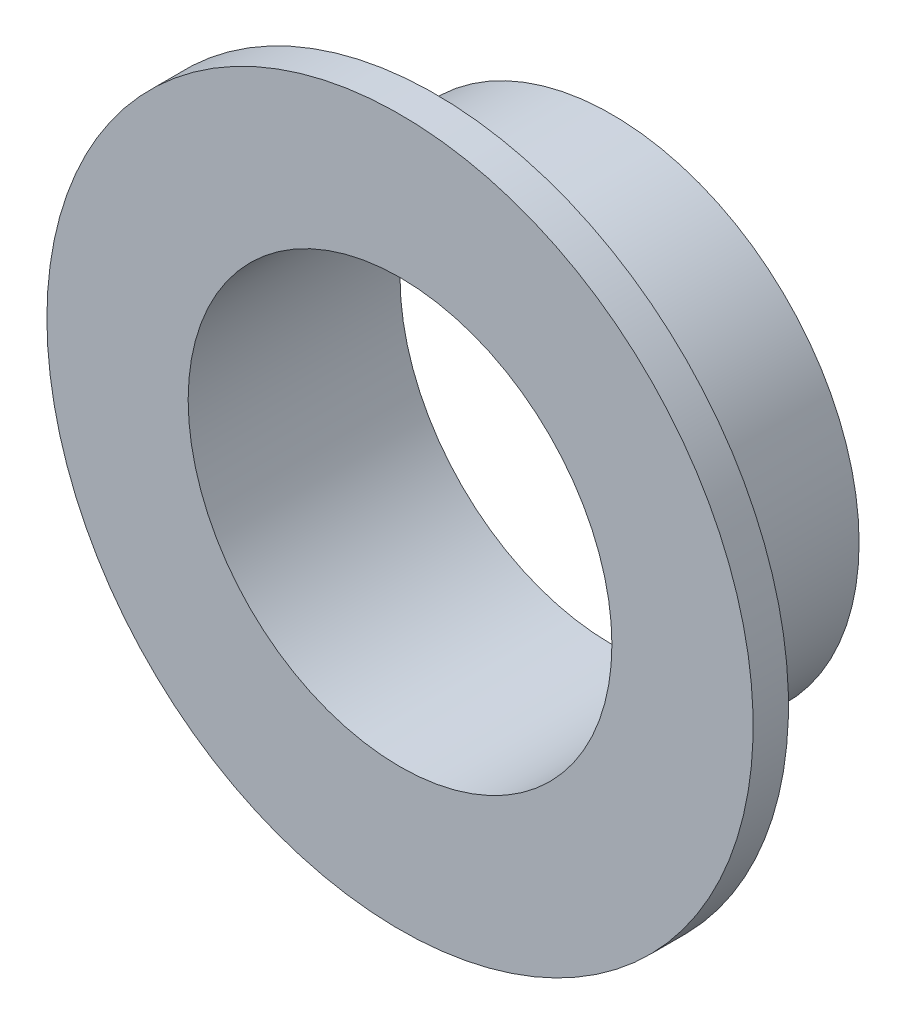
ISO-10303-21;
HEADER;
FILE_DESCRIPTION(('STEP AP214'),'2;1');
FILE_NAME('part.step','',(''),(''),'','','');
FILE_SCHEMA(('AUTOMOTIVE_DESIGN { 1 0 10303 214 1 1 1 1 }'));
ENDSEC;
DATA;
#1=APPLICATION_CONTEXT('core data for automotive mechanical design processes');
#2=APPLICATION_PROTOCOL_DEFINITION('international standard','automotive_design',2000,#1);
#3=PRODUCT_CONTEXT('',#1,'mechanical');
#4=PRODUCT('Part','Part','',(#3));
#5=PRODUCT_RELATED_PRODUCT_CATEGORY('part','',(#4));
#6=PRODUCT_DEFINITION_FORMATION('','',#4);
#7=PRODUCT_DEFINITION_CONTEXT('part definition',#1,'design');
#8=PRODUCT_DEFINITION('design','',#6,#7);
#9=PRODUCT_DEFINITION_SHAPE('','',#8);
#10=(LENGTH_UNIT() NAMED_UNIT(*) SI_UNIT(.MILLI.,.METRE.));
#11=(NAMED_UNIT(*) PLANE_ANGLE_UNIT() SI_UNIT($,.RADIAN.));
#12=(NAMED_UNIT(*) SI_UNIT($,.STERADIAN.) SOLID_ANGLE_UNIT());
#13=UNCERTAINTY_MEASURE_WITH_UNIT(LENGTH_MEASURE(1.E-05),#10,'distance_accuracy_value','');
#14=(GEOMETRIC_REPRESENTATION_CONTEXT(3) GLOBAL_UNCERTAINTY_ASSIGNED_CONTEXT((#13)) GLOBAL_UNIT_ASSIGNED_CONTEXT((#10,
#11,#12)) REPRESENTATION_CONTEXT('',''));
#15=CARTESIAN_POINT('',(0.,0.,0.));
#16=DIRECTION('',(0.,0.,1.));
#17=DIRECTION('',(1.,0.,0.));
#18=AXIS2_PLACEMENT_3D('',#15,#16,#17);
#19=CARTESIAN_POINT('',(0.,0.,0.));
#20=DIRECTION('',(0.,0.,-1.));
#21=DIRECTION('',(-1.,0.,0.));
#22=AXIS2_PLACEMENT_3D('',#19,#20,#21);
#23=CYLINDRICAL_SURFACE('',#22,9.99999999999996);
#24=CARTESIAN_POINT('',(0.,0.,338.453390593277));
#25=DIRECTION('',(0.,0.,-1.));
#26=DIRECTION('',(-1.,0.,0.));
#27=AXIS2_PLACEMENT_3D('',#24,#25,#26);
#28=CIRCLE('',#27,9.99999999999996);
#29=CARTESIAN_POINT('',(-9.99999999999996,0.,338.453390593277));
#30=VERTEX_POINT('',#29);
#31=EDGE_CURVE('E10',#30,#30,#28,.T.);
#32=ORIENTED_EDGE('',*,*,#31,.T.);
#33=EDGE_LOOP('',(#32));
#34=FACE_BOUND('',#33,.T.);
#35=CARTESIAN_POINT('',(0.,0.,337.453390593277));
#36=DIRECTION('',(0.,0.,-1.));
#37=DIRECTION('',(-1.,0.,0.));
#38=AXIS2_PLACEMENT_3D('',#35,#36,#37);
#39=CIRCLE('',#38,9.99999999999996);
#40=CARTESIAN_POINT('',(-9.99999999999996,0.,337.453390593277));
#41=VERTEX_POINT('',#40);
#42=EDGE_CURVE('E55',#41,#41,#39,.T.);
#43=ORIENTED_EDGE('',*,*,#42,.F.);
#44=EDGE_LOOP('',(#43));
#45=FACE_BOUND('',#44,.T.);
#46=ADVANCED_FACE('F33',(#34,#45),#23,.T.);
#47=CARTESIAN_POINT('',(0.,9.99999999999996,338.453390593277));
#48=DIRECTION('',(0.,0.,1.));
#49=DIRECTION('',(1.,0.,0.));
#50=AXIS2_PLACEMENT_3D('',#47,#48,#49);
#51=PLANE('',#50);
#52=CARTESIAN_POINT('',(0.,0.,338.453390593277));
#53=DIRECTION('',(0.,0.,-1.));
#54=DIRECTION('',(-1.,0.,0.));
#55=AXIS2_PLACEMENT_3D('',#52,#53,#54);
#56=CIRCLE('',#55,6.);
#57=CARTESIAN_POINT('',(-6.,0.,338.453390593277));
#58=VERTEX_POINT('',#57);
#59=EDGE_CURVE('E39',#58,#58,#56,.T.);
#60=ORIENTED_EDGE('',*,*,#59,.T.);
#61=EDGE_LOOP('',(#60));
#62=FACE_BOUND('',#61,.T.);
#63=ORIENTED_EDGE('',*,*,#31,.F.);
#64=EDGE_LOOP('',(#63));
#65=FACE_BOUND('',#64,.T.);
#66=ADVANCED_FACE('F63',(#62,#65),#51,.T.);
#67=CARTESIAN_POINT('',(0.,0.,0.));
#68=DIRECTION('',(0.,0.,-1.));
#69=DIRECTION('',(-1.,0.,0.));
#70=AXIS2_PLACEMENT_3D('',#67,#68,#69);
#71=CYLINDRICAL_SURFACE('',#70,6.);
#72=CARTESIAN_POINT('',(0.,0.,332.453390593277));
#73=DIRECTION('',(0.,0.,-1.));
#74=DIRECTION('',(-1.,0.,0.));
#75=AXIS2_PLACEMENT_3D('',#72,#73,#74);
#76=CIRCLE('',#75,6.);
#77=CARTESIAN_POINT('',(-6.,0.,332.453390593277));
#78=VERTEX_POINT('',#77);
#79=EDGE_CURVE('E43',#78,#78,#76,.T.);
#80=ORIENTED_EDGE('',*,*,#79,.T.);
#81=EDGE_LOOP('',(#80));
#82=FACE_BOUND('',#81,.T.);
#83=ORIENTED_EDGE('',*,*,#59,.F.);
#84=EDGE_LOOP('',(#83));
#85=FACE_BOUND('',#84,.T.);
#86=ADVANCED_FACE('F67',(#82,#85),#71,.F.);
#87=CARTESIAN_POINT('',(0.,6.,332.453390593277));
#88=DIRECTION('',(0.,0.,-1.));
#89=DIRECTION('',(-1.,0.,0.));
#90=AXIS2_PLACEMENT_3D('',#87,#88,#89);
#91=PLANE('',#90);
#92=CARTESIAN_POINT('',(0.,0.,332.453390593277));
#93=DIRECTION('',(0.,0.,-1.));
#94=DIRECTION('',(-1.,0.,0.));
#95=AXIS2_PLACEMENT_3D('',#92,#93,#94);
#96=CIRCLE('',#95,6.99999999999996);
#97=CARTESIAN_POINT('',(-6.99999999999996,0.,332.453390593277));
#98=VERTEX_POINT('',#97);
#99=EDGE_CURVE('E47',#98,#98,#96,.T.);
#100=ORIENTED_EDGE('',*,*,#99,.T.);
#101=EDGE_LOOP('',(#100));
#102=FACE_BOUND('',#101,.T.);
#103=ORIENTED_EDGE('',*,*,#79,.F.);
#104=EDGE_LOOP('',(#103));
#105=FACE_BOUND('',#104,.T.);
#106=ADVANCED_FACE('F71',(#102,#105),#91,.T.);
#107=CARTESIAN_POINT('',(0.,0.,0.));
#108=DIRECTION('',(0.,0.,-1.));
#109=DIRECTION('',(-1.,0.,0.));
#110=AXIS2_PLACEMENT_3D('',#107,#108,#109);
#111=CYLINDRICAL_SURFACE('',#110,6.99999999999996);
#112=CARTESIAN_POINT('',(0.,0.,337.453390593277));
#113=DIRECTION('',(0.,0.,-1.));
#114=DIRECTION('',(-1.,0.,0.));
#115=AXIS2_PLACEMENT_3D('',#112,#113,#114);
#116=CIRCLE('',#115,6.99999999999996);
#117=CARTESIAN_POINT('',(-6.99999999999996,0.,337.453390593277));
#118=VERTEX_POINT('',#117);
#119=EDGE_CURVE('E52',#118,#118,#116,.T.);
#120=ORIENTED_EDGE('',*,*,#119,.T.);
#121=EDGE_LOOP('',(#120));
#122=FACE_BOUND('',#121,.T.);
#123=ORIENTED_EDGE('',*,*,#99,.F.);
#124=EDGE_LOOP('',(#123));
#125=FACE_BOUND('',#124,.T.);
#126=ADVANCED_FACE('F78',(#122,#125),#111,.T.);
#127=CARTESIAN_POINT('',(0.,6.99999999999996,337.453390593277));
#128=DIRECTION('',(0.,0.,-1.));
#129=DIRECTION('',(-1.,0.,0.));
#130=AXIS2_PLACEMENT_3D('',#127,#128,#129);
#131=PLANE('',#130);
#132=ORIENTED_EDGE('',*,*,#42,.T.);
#133=EDGE_LOOP('',(#132));
#134=FACE_BOUND('',#133,.T.);
#135=ORIENTED_EDGE('',*,*,#119,.F.);
#136=EDGE_LOOP('',(#135));
#137=FACE_BOUND('',#136,.T.);
#138=ADVANCED_FACE('F59',(#134,#137),#131,.T.);
#139=CLOSED_SHELL('',(#46,#66,#86,#106,#126,#138));
#140=MANIFOLD_SOLID_BREP('B2',#139);
#141=ADVANCED_BREP_SHAPE_REPRESENTATION('',(#18,#140),#14);
#142=SHAPE_DEFINITION_REPRESENTATION(#9,#141);
ENDSEC;
END-ISO-10303-21;
